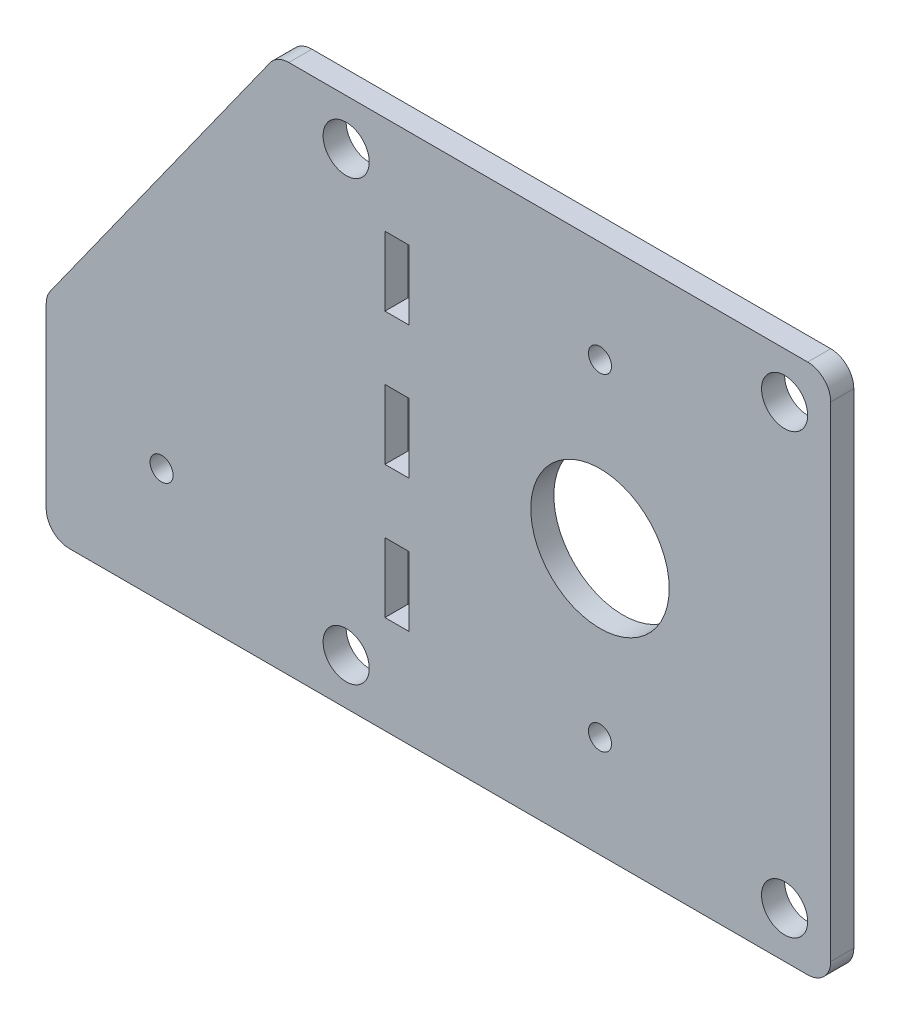
ISO-10303-21;
HEADER;
FILE_DESCRIPTION(('STEP AP214'),'2;1');
FILE_NAME('part.step','',(''),(''),'','','');
FILE_SCHEMA(('AUTOMOTIVE_DESIGN { 1 0 10303 214 1 1 1 1 }'));
ENDSEC;
DATA;
#1=APPLICATION_CONTEXT('core data for automotive mechanical design processes');
#2=APPLICATION_PROTOCOL_DEFINITION('international standard','automotive_design',2000,#1);
#3=PRODUCT_CONTEXT('',#1,'mechanical');
#4=PRODUCT('Part','Part','',(#3));
#5=PRODUCT_RELATED_PRODUCT_CATEGORY('part','',(#4));
#6=PRODUCT_DEFINITION_FORMATION('','',#4);
#7=PRODUCT_DEFINITION_CONTEXT('part definition',#1,'design');
#8=PRODUCT_DEFINITION('design','',#6,#7);
#9=PRODUCT_DEFINITION_SHAPE('','',#8);
#10=(LENGTH_UNIT() NAMED_UNIT(*) SI_UNIT(.MILLI.,.METRE.));
#11=(NAMED_UNIT(*) PLANE_ANGLE_UNIT() SI_UNIT($,.RADIAN.));
#12=(NAMED_UNIT(*) SI_UNIT($,.STERADIAN.) SOLID_ANGLE_UNIT());
#13=UNCERTAINTY_MEASURE_WITH_UNIT(LENGTH_MEASURE(1.E-05),#10,'distance_accuracy_value','');
#14=(GEOMETRIC_REPRESENTATION_CONTEXT(3) GLOBAL_UNCERTAINTY_ASSIGNED_CONTEXT((#13)) GLOBAL_UNIT_ASSIGNED_CONTEXT((#10,
#11,#12)) REPRESENTATION_CONTEXT('',''));
#15=CARTESIAN_POINT('',(0.,0.,0.));
#16=DIRECTION('',(0.,0.,1.));
#17=DIRECTION('',(1.,0.,0.));
#18=AXIS2_PLACEMENT_3D('',#15,#16,#17);
#19=CARTESIAN_POINT('',(0.,0.,3.175));
#20=DIRECTION('',(0.,0.,-1.));
#21=DIRECTION('',(-1.,0.,0.));
#22=AXIS2_PLACEMENT_3D('',#19,#20,#21);
#23=PLANE('',#22);
#24=CARTESIAN_POINT('',(-120.65,-41.275,3.175));
#25=DIRECTION('',(0.,0.,1.));
#26=DIRECTION('',(1.,0.,0.));
#27=AXIS2_PLACEMENT_3D('',#24,#25,#26);
#28=CIRCLE('',#27,3.175);
#29=CARTESIAN_POINT('',(-117.475,-41.275,3.175));
#30=VERTEX_POINT('',#29);
#31=EDGE_CURVE('E435',#30,#30,#28,.T.);
#32=ORIENTED_EDGE('',*,*,#31,.F.);
#33=EDGE_LOOP('',(#32));
#34=FACE_BOUND('',#33,.T.);
#35=DIRECTION('',(0.,1.,0.));
#36=VECTOR('',#35,1.);
#37=CARTESIAN_POINT('',(-52.578,-9.525,3.175));
#38=LINE('',#37,#36);
#39=CARTESIAN_POINT('',(-52.578,-9.525,3.175));
#40=VERTEX_POINT('',#39);
#41=CARTESIAN_POINT('',(-52.578,9.525,3.175));
#42=VERTEX_POINT('',#41);
#43=EDGE_CURVE('E228',#40,#42,#38,.T.);
#44=ORIENTED_EDGE('',*,*,#43,.F.);
#45=DIRECTION('',(1.,0.,0.));
#46=VECTOR('',#45,1.);
#47=CARTESIAN_POINT('',(-59.182,-9.525,3.175));
#48=LINE('',#47,#46);
#49=CARTESIAN_POINT('',(-59.182,-9.525,3.175));
#50=VERTEX_POINT('',#49);
#51=EDGE_CURVE('E236',#50,#40,#48,.T.);
#52=ORIENTED_EDGE('',*,*,#51,.F.);
#53=DIRECTION('',(0.,-1.,0.));
#54=VECTOR('',#53,1.);
#55=CARTESIAN_POINT('',(-59.182,-9.525,3.175));
#56=LINE('',#55,#54);
#57=CARTESIAN_POINT('',(-59.182,9.525,3.175));
#58=VERTEX_POINT('',#57);
#59=EDGE_CURVE('E233',#58,#50,#56,.T.);
#60=ORIENTED_EDGE('',*,*,#59,.F.);
#61=DIRECTION('',(-1.,0.,0.));
#62=VECTOR('',#61,1.);
#63=CARTESIAN_POINT('',(-59.182,9.525,3.175));
#64=LINE('',#63,#62);
#65=EDGE_CURVE('E230',#42,#58,#64,.T.);
#66=ORIENTED_EDGE('',*,*,#65,.F.);
#67=EDGE_LOOP('',(#44,#52,#60,#66));
#68=FACE_BOUND('',#67,.T.);
#69=CARTESIAN_POINT('',(-69.85,-60.325,3.175));
#70=DIRECTION('',(0.,0.,1.));
#71=DIRECTION('',(1.,0.,0.));
#72=AXIS2_PLACEMENT_3D('',#69,#70,#71);
#73=CIRCLE('',#72,6.35000000000001);
#74=CARTESIAN_POINT('',(-63.5,-60.325,3.175));
#75=VERTEX_POINT('',#74);
#76=EDGE_CURVE('E290',#75,#75,#73,.T.);
#77=ORIENTED_EDGE('',*,*,#76,.F.);
#78=EDGE_LOOP('',(#77));
#79=FACE_BOUND('',#78,.T.);
#80=CARTESIAN_POINT('',(-69.85,60.325,3.175));
#81=DIRECTION('',(0.,0.,1.));
#82=DIRECTION('',(1.,0.,0.));
#83=AXIS2_PLACEMENT_3D('',#80,#81,#82);
#84=CIRCLE('',#83,6.35000000000001);
#85=CARTESIAN_POINT('',(-63.5,60.325,3.175));
#86=VERTEX_POINT('',#85);
#87=EDGE_CURVE('E296',#86,#86,#84,.T.);
#88=ORIENTED_EDGE('',*,*,#87,.F.);
#89=EDGE_LOOP('',(#88));
#90=FACE_BOUND('',#89,.T.);
#91=CARTESIAN_POINT('',(0.,-45.,3.175));
#92=DIRECTION('',(0.,0.,1.));
#93=DIRECTION('',(1.,0.,0.));
#94=AXIS2_PLACEMENT_3D('',#91,#92,#93);
#95=CIRCLE('',#94,3.175);
#96=CARTESIAN_POINT('',(3.17500000000001,-45.,3.175));
#97=VERTEX_POINT('',#96);
#98=EDGE_CURVE('E302',#97,#97,#95,.T.);
#99=ORIENTED_EDGE('',*,*,#98,.F.);
#100=EDGE_LOOP('',(#99));
#101=FACE_BOUND('',#100,.T.);
#102=CARTESIAN_POINT('',(0.,0.,3.175));
#103=DIRECTION('',(0.,0.,1.));
#104=DIRECTION('',(1.,0.,0.));
#105=AXIS2_PLACEMENT_3D('',#102,#103,#104);
#106=CIRCLE('',#105,19.05);
#107=CARTESIAN_POINT('',(19.05,0.,3.175));
#108=VERTEX_POINT('',#107);
#109=EDGE_CURVE('E308',#108,#108,#106,.T.);
#110=ORIENTED_EDGE('',*,*,#109,.F.);
#111=EDGE_LOOP('',(#110));
#112=FACE_BOUND('',#111,.T.);
#113=CARTESIAN_POINT('',(0.,45.,3.175));
#114=DIRECTION('',(0.,0.,1.));
#115=DIRECTION('',(1.,0.,0.));
#116=AXIS2_PLACEMENT_3D('',#113,#114,#115);
#117=CIRCLE('',#116,3.175);
#118=CARTESIAN_POINT('',(3.17499999999999,45.,3.175));
#119=VERTEX_POINT('',#118);
#120=EDGE_CURVE('E314',#119,#119,#117,.T.);
#121=ORIENTED_EDGE('',*,*,#120,.F.);
#122=EDGE_LOOP('',(#121));
#123=FACE_BOUND('',#122,.T.);
#124=CARTESIAN_POINT('',(50.8,-60.325,3.175));
#125=DIRECTION('',(0.,0.,1.));
#126=DIRECTION('',(1.,0.,0.));
#127=AXIS2_PLACEMENT_3D('',#124,#125,#126);
#128=CIRCLE('',#127,6.35);
#129=CARTESIAN_POINT('',(57.15,-60.325,3.175));
#130=VERTEX_POINT('',#129);
#131=EDGE_CURVE('E320',#130,#130,#128,.T.);
#132=ORIENTED_EDGE('',*,*,#131,.F.);
#133=EDGE_LOOP('',(#132));
#134=FACE_BOUND('',#133,.T.);
#135=CARTESIAN_POINT('',(50.8,60.325,3.175));
#136=DIRECTION('',(0.,0.,1.));
#137=DIRECTION('',(1.,0.,0.));
#138=AXIS2_PLACEMENT_3D('',#135,#136,#137);
#139=CIRCLE('',#138,6.35);
#140=CARTESIAN_POINT('',(57.15,60.325,3.175));
#141=VERTEX_POINT('',#140);
#142=EDGE_CURVE('E326',#141,#141,#139,.T.);
#143=ORIENTED_EDGE('',*,*,#142,.F.);
#144=EDGE_LOOP('',(#143));
#145=FACE_BOUND('',#144,.T.);
#146=DIRECTION('',(0.,1.,0.));
#147=VECTOR('',#146,1.);
#148=CARTESIAN_POINT('',(63.5,73.025,3.175));
#149=LINE('',#148,#147);
#150=CARTESIAN_POINT('',(63.5,-66.675,3.175));
#151=VERTEX_POINT('',#150);
#152=CARTESIAN_POINT('',(63.5,66.675,3.175));
#153=VERTEX_POINT('',#152);
#154=EDGE_CURVE('E337',#151,#153,#149,.T.);
#155=ORIENTED_EDGE('',*,*,#154,.T.);
#156=CARTESIAN_POINT('',(57.15,66.675,3.175));
#157=DIRECTION('',(0.,0.,-1.));
#158=DIRECTION('',(-1.,0.,0.));
#159=AXIS2_PLACEMENT_3D('',#156,#157,#158);
#160=CIRCLE('',#159,6.35);
#161=CARTESIAN_POINT('',(57.15,73.025,3.175));
#162=VERTEX_POINT('',#161);
#163=EDGE_CURVE('E380',#153,#162,#160,.F.);
#164=ORIENTED_EDGE('',*,*,#163,.T.);
#165=DIRECTION('',(-1.,0.,0.));
#166=VECTOR('',#165,1.);
#167=CARTESIAN_POINT('',(63.5,73.025,3.175));
#168=LINE('',#167,#166);
#169=CARTESIAN_POINT('',(-85.6321763648971,73.025,3.175));
#170=VERTEX_POINT('',#169);
#171=EDGE_CURVE('E340',#162,#170,#168,.T.);
#172=ORIENTED_EDGE('',*,*,#171,.T.);
#173=CARTESIAN_POINT('',(-85.6321763648971,66.675,3.175));
#174=DIRECTION('',(0.,0.,-1.));
#175=DIRECTION('',(-1.,0.,0.));
#176=AXIS2_PLACEMENT_3D('',#173,#174,#175);
#177=CIRCLE('',#176,6.35);
#178=CARTESIAN_POINT('',(-90.7993839070598,70.3658625301163,3.175));
#179=VERTEX_POINT('',#178);
#180=EDGE_CURVE('E376',#170,#179,#177,.F.);
#181=ORIENTED_EDGE('',*,*,#180,.T.);
#182=DIRECTION('',(0.581238193719096,0.813733471206735,0.));
#183=VECTOR('',#182,1.);
#184=CARTESIAN_POINT('',(-88.9,73.025,3.175));
#185=LINE('',#184,#183);
#186=CARTESIAN_POINT('',(-151.217207542163,-14.2190905590279,3.175));
#187=VERTEX_POINT('',#186);
#188=EDGE_CURVE('E431',#187,#179,#185,.T.);
#189=ORIENTED_EDGE('',*,*,#188,.F.);
#190=CARTESIAN_POINT('',(-146.05,-17.9099530891441,3.175));
#191=DIRECTION('',(0.,0.,-1.));
#192=DIRECTION('',(-1.,0.,0.));
#193=AXIS2_PLACEMENT_3D('',#190,#191,#192);
#194=CIRCLE('',#193,6.35);
#195=CARTESIAN_POINT('',(-152.4,-17.9099530891441,3.175));
#196=VERTEX_POINT('',#195);
#197=EDGE_CURVE('E374',#187,#196,#194,.F.);
#198=ORIENTED_EDGE('',*,*,#197,.T.);
#199=DIRECTION('',(0.,-1.,0.));
#200=VECTOR('',#199,1.);
#201=CARTESIAN_POINT('',(-152.4,73.025,3.175));
#202=LINE('',#201,#200);
#203=CARTESIAN_POINT('',(-152.4,-66.675,3.175));
#204=VERTEX_POINT('',#203);
#205=EDGE_CURVE('E332',#196,#204,#202,.T.);
#206=ORIENTED_EDGE('',*,*,#205,.T.);
#207=CARTESIAN_POINT('',(-146.05,-66.675,3.175));
#208=DIRECTION('',(0.,0.,-1.));
#209=DIRECTION('',(-1.,0.,0.));
#210=AXIS2_PLACEMENT_3D('',#207,#208,#209);
#211=CIRCLE('',#210,6.35);
#212=CARTESIAN_POINT('',(-146.05,-73.025,3.175));
#213=VERTEX_POINT('',#212);
#214=EDGE_CURVE('E56',#204,#213,#211,.F.);
#215=ORIENTED_EDGE('',*,*,#214,.T.);
#216=DIRECTION('',(1.,0.,0.));
#217=VECTOR('',#216,1.);
#218=CARTESIAN_POINT('',(63.5,-73.025,3.175));
#219=LINE('',#218,#217);
#220=CARTESIAN_POINT('',(57.15,-73.025,3.175));
#221=VERTEX_POINT('',#220);
#222=EDGE_CURVE('E334',#213,#221,#219,.T.);
#223=ORIENTED_EDGE('',*,*,#222,.T.);
#224=CARTESIAN_POINT('',(57.15,-66.675,3.175));
#225=DIRECTION('',(0.,0.,-1.));
#226=DIRECTION('',(-1.,0.,0.));
#227=AXIS2_PLACEMENT_3D('',#224,#225,#226);
#228=CIRCLE('',#227,6.35);
#229=EDGE_CURVE('E378',#221,#151,#228,.F.);
#230=ORIENTED_EDGE('',*,*,#229,.T.);
#231=EDGE_LOOP('',(#155,#164,#172,#181,#189,#198,#206,#215,#223,#230));
#232=FACE_BOUND('',#231,.T.);
#233=DIRECTION('',(0.,1.,0.));
#234=VECTOR('',#233,1.);
#235=CARTESIAN_POINT('',(-52.578,46.0375,3.175));
#236=LINE('',#235,#234);
#237=CARTESIAN_POINT('',(-52.578,26.9875,3.175));
#238=VERTEX_POINT('',#237);
#239=CARTESIAN_POINT('',(-52.578,46.0375,3.175));
#240=VERTEX_POINT('',#239);
#241=EDGE_CURVE('E259',#238,#240,#236,.T.);
#242=ORIENTED_EDGE('',*,*,#241,.F.);
#243=DIRECTION('',(1.,0.,0.));
#244=VECTOR('',#243,1.);
#245=CARTESIAN_POINT('',(-59.182,26.9875,3.175));
#246=LINE('',#245,#244);
#247=CARTESIAN_POINT('',(-59.182,26.9875,3.175));
#248=VERTEX_POINT('',#247);
#249=EDGE_CURVE('E267',#248,#238,#246,.T.);
#250=ORIENTED_EDGE('',*,*,#249,.F.);
#251=DIRECTION('',(0.,-1.,0.));
#252=VECTOR('',#251,1.);
#253=CARTESIAN_POINT('',(-59.182,46.0375,3.175));
#254=LINE('',#253,#252);
#255=CARTESIAN_POINT('',(-59.182,46.0375,3.175));
#256=VERTEX_POINT('',#255);
#257=EDGE_CURVE('E264',#256,#248,#254,.T.);
#258=ORIENTED_EDGE('',*,*,#257,.F.);
#259=DIRECTION('',(-1.,0.,0.));
#260=VECTOR('',#259,1.);
#261=CARTESIAN_POINT('',(-59.182,46.0375,3.175));
#262=LINE('',#261,#260);
#263=EDGE_CURVE('E261',#240,#256,#262,.T.);
#264=ORIENTED_EDGE('',*,*,#263,.F.);
#265=EDGE_LOOP('',(#242,#250,#258,#264));
#266=FACE_BOUND('',#265,.T.);
#267=DIRECTION('',(0.,1.,0.));
#268=VECTOR('',#267,1.);
#269=CARTESIAN_POINT('',(-52.578,-26.9875,3.175));
#270=LINE('',#269,#268);
#271=CARTESIAN_POINT('',(-52.578,-46.0375,3.175));
#272=VERTEX_POINT('',#271);
#273=CARTESIAN_POINT('',(-52.578,-26.9875,3.175));
#274=VERTEX_POINT('',#273);
#275=EDGE_CURVE('E185',#272,#274,#270,.T.);
#276=ORIENTED_EDGE('',*,*,#275,.F.);
#277=DIRECTION('',(1.,0.,0.));
#278=VECTOR('',#277,1.);
#279=CARTESIAN_POINT('',(-59.182,-46.0375,3.175));
#280=LINE('',#279,#278);
#281=CARTESIAN_POINT('',(-59.182,-46.0375,3.175));
#282=VERTEX_POINT('',#281);
#283=EDGE_CURVE('E210',#282,#272,#280,.T.);
#284=ORIENTED_EDGE('',*,*,#283,.F.);
#285=DIRECTION('',(0.,-1.,0.));
#286=VECTOR('',#285,1.);
#287=CARTESIAN_POINT('',(-59.182,-26.9875,3.175));
#288=LINE('',#287,#286);
#289=CARTESIAN_POINT('',(-59.182,-26.9875,3.175));
#290=VERTEX_POINT('',#289);
#291=EDGE_CURVE('E208',#290,#282,#288,.T.);
#292=ORIENTED_EDGE('',*,*,#291,.F.);
#293=DIRECTION('',(-1.,0.,0.));
#294=VECTOR('',#293,1.);
#295=CARTESIAN_POINT('',(-59.182,-26.9875,3.175));
#296=LINE('',#295,#294);
#297=EDGE_CURVE('E195',#274,#290,#296,.T.);
#298=ORIENTED_EDGE('',*,*,#297,.F.);
#299=EDGE_LOOP('',(#276,#284,#292,#298));
#300=FACE_BOUND('',#299,.T.);
#301=ADVANCED_FACE('F34',(#34,#68,#79,#90,#101,#112,#123,#134,#145,#232,#266,#300),#23,.F.);
#302=CARTESIAN_POINT('',(0.,0.,-3.175));
#303=DIRECTION('',(0.,0.,-1.));
#304=DIRECTION('',(-1.,0.,0.));
#305=AXIS2_PLACEMENT_3D('',#302,#303,#304);
#306=PLANE('',#305);
#307=CARTESIAN_POINT('',(-120.65,-41.275,-3.175));
#308=DIRECTION('',(0.,0.,1.));
#309=DIRECTION('',(1.,0.,0.));
#310=AXIS2_PLACEMENT_3D('',#307,#308,#309);
#311=CIRCLE('',#310,3.175);
#312=CARTESIAN_POINT('',(-117.475,-41.275,-3.175));
#313=VERTEX_POINT('',#312);
#314=EDGE_CURVE('E217',#313,#313,#311,.T.);
#315=ORIENTED_EDGE('',*,*,#314,.T.);
#316=EDGE_LOOP('',(#315));
#317=FACE_BOUND('',#316,.T.);
#318=DIRECTION('',(-1.,0.,0.));
#319=VECTOR('',#318,1.);
#320=CARTESIAN_POINT('',(63.5,73.025,-3.175));
#321=LINE('',#320,#319);
#322=CARTESIAN_POINT('',(57.15,73.025,-3.175));
#323=VERTEX_POINT('',#322);
#324=CARTESIAN_POINT('',(-85.6321763648971,73.025,-3.175));
#325=VERTEX_POINT('',#324);
#326=EDGE_CURVE('E335',#323,#325,#321,.T.);
#327=ORIENTED_EDGE('',*,*,#326,.F.);
#328=CARTESIAN_POINT('',(57.15,66.675,-3.175));
#329=DIRECTION('',(0.,0.,-1.));
#330=DIRECTION('',(-1.,0.,0.));
#331=AXIS2_PLACEMENT_3D('',#328,#329,#330);
#332=CIRCLE('',#331,6.35);
#333=CARTESIAN_POINT('',(63.5,66.675,-3.175));
#334=VERTEX_POINT('',#333);
#335=EDGE_CURVE('E366',#323,#334,#332,.T.);
#336=ORIENTED_EDGE('',*,*,#335,.T.);
#337=DIRECTION('',(0.,1.,0.));
#338=VECTOR('',#337,1.);
#339=CARTESIAN_POINT('',(63.5,73.025,-3.175));
#340=LINE('',#339,#338);
#341=CARTESIAN_POINT('',(63.5,-66.675,-3.175));
#342=VERTEX_POINT('',#341);
#343=EDGE_CURVE('E348',#342,#334,#340,.T.);
#344=ORIENTED_EDGE('',*,*,#343,.F.);
#345=CARTESIAN_POINT('',(57.15,-66.675,-3.175));
#346=DIRECTION('',(0.,0.,-1.));
#347=DIRECTION('',(-1.,0.,0.));
#348=AXIS2_PLACEMENT_3D('',#345,#346,#347);
#349=CIRCLE('',#348,6.35);
#350=CARTESIAN_POINT('',(57.15,-73.025,-3.175));
#351=VERTEX_POINT('',#350);
#352=EDGE_CURVE('E364',#342,#351,#349,.T.);
#353=ORIENTED_EDGE('',*,*,#352,.T.);
#354=DIRECTION('',(1.,0.,0.));
#355=VECTOR('',#354,1.);
#356=CARTESIAN_POINT('',(63.5,-73.025,-3.175));
#357=LINE('',#356,#355);
#358=CARTESIAN_POINT('',(-146.05,-73.025,-3.175));
#359=VERTEX_POINT('',#358);
#360=EDGE_CURVE('E346',#359,#351,#357,.T.);
#361=ORIENTED_EDGE('',*,*,#360,.F.);
#362=CARTESIAN_POINT('',(-146.05,-66.675,-3.175));
#363=DIRECTION('',(0.,0.,-1.));
#364=DIRECTION('',(-1.,0.,0.));
#365=AXIS2_PLACEMENT_3D('',#362,#363,#364);
#366=CIRCLE('',#365,6.35);
#367=CARTESIAN_POINT('',(-152.4,-66.675,-3.175));
#368=VERTEX_POINT('',#367);
#369=EDGE_CURVE('E358',#359,#368,#366,.T.);
#370=ORIENTED_EDGE('',*,*,#369,.T.);
#371=DIRECTION('',(0.,-1.,0.));
#372=VECTOR('',#371,1.);
#373=CARTESIAN_POINT('',(-152.4,73.025,-3.175));
#374=LINE('',#373,#372);
#375=CARTESIAN_POINT('',(-152.4,-17.9099530891441,-3.175));
#376=VERTEX_POINT('',#375);
#377=EDGE_CURVE('E329',#376,#368,#374,.T.);
#378=ORIENTED_EDGE('',*,*,#377,.F.);
#379=CARTESIAN_POINT('',(-146.05,-17.9099530891441,-3.175));
#380=DIRECTION('',(0.,0.,-1.));
#381=DIRECTION('',(-1.,0.,0.));
#382=AXIS2_PLACEMENT_3D('',#379,#380,#381);
#383=CIRCLE('',#382,6.35);
#384=CARTESIAN_POINT('',(-151.217207542163,-14.2190905590279,-3.175));
#385=VERTEX_POINT('',#384);
#386=EDGE_CURVE('E360',#376,#385,#383,.T.);
#387=ORIENTED_EDGE('',*,*,#386,.T.);
#388=DIRECTION('',(0.581238193719096,0.813733471206735,0.));
#389=VECTOR('',#388,1.);
#390=CARTESIAN_POINT('',(-88.9,73.025,-3.175));
#391=LINE('',#390,#389);
#392=CARTESIAN_POINT('',(-90.7993839070598,70.3658625301163,-3.175));
#393=VERTEX_POINT('',#392);
#394=EDGE_CURVE('E426',#385,#393,#391,.T.);
#395=ORIENTED_EDGE('',*,*,#394,.T.);
#396=CARTESIAN_POINT('',(-85.6321763648971,66.675,-3.175));
#397=DIRECTION('',(0.,0.,-1.));
#398=DIRECTION('',(-1.,0.,0.));
#399=AXIS2_PLACEMENT_3D('',#396,#397,#398);
#400=CIRCLE('',#399,6.35);
#401=EDGE_CURVE('E362',#393,#325,#400,.T.);
#402=ORIENTED_EDGE('',*,*,#401,.T.);
#403=EDGE_LOOP('',(#327,#336,#344,#353,#361,#370,#378,#387,#395,#402));
#404=FACE_BOUND('',#403,.T.);
#405=CARTESIAN_POINT('',(-69.85,60.325,-3.175));
#406=DIRECTION('',(0.,0.,1.));
#407=DIRECTION('',(1.,0.,0.));
#408=AXIS2_PLACEMENT_3D('',#405,#406,#407);
#409=CIRCLE('',#408,6.35000000000001);
#410=CARTESIAN_POINT('',(-63.5,60.325,-3.175));
#411=VERTEX_POINT('',#410);
#412=EDGE_CURVE('E293',#411,#411,#409,.T.);
#413=ORIENTED_EDGE('',*,*,#412,.T.);
#414=EDGE_LOOP('',(#413));
#415=FACE_BOUND('',#414,.T.);
#416=CARTESIAN_POINT('',(0.,0.,-3.175));
#417=DIRECTION('',(0.,0.,1.));
#418=DIRECTION('',(1.,0.,0.));
#419=AXIS2_PLACEMENT_3D('',#416,#417,#418);
#420=CIRCLE('',#419,19.05);
#421=CARTESIAN_POINT('',(19.05,0.,-3.175));
#422=VERTEX_POINT('',#421);
#423=EDGE_CURVE('E305',#422,#422,#420,.T.);
#424=ORIENTED_EDGE('',*,*,#423,.T.);
#425=EDGE_LOOP('',(#424));
#426=FACE_BOUND('',#425,.T.);
#427=CARTESIAN_POINT('',(50.8,-60.325,-3.175));
#428=DIRECTION('',(0.,0.,1.));
#429=DIRECTION('',(1.,0.,0.));
#430=AXIS2_PLACEMENT_3D('',#427,#428,#429);
#431=CIRCLE('',#430,6.35);
#432=CARTESIAN_POINT('',(57.15,-60.325,-3.175));
#433=VERTEX_POINT('',#432);
#434=EDGE_CURVE('E317',#433,#433,#431,.T.);
#435=ORIENTED_EDGE('',*,*,#434,.T.);
#436=EDGE_LOOP('',(#435));
#437=FACE_BOUND('',#436,.T.);
#438=CARTESIAN_POINT('',(50.8,60.325,-3.175));
#439=DIRECTION('',(0.,0.,1.));
#440=DIRECTION('',(1.,0.,0.));
#441=AXIS2_PLACEMENT_3D('',#438,#439,#440);
#442=CIRCLE('',#441,6.35);
#443=CARTESIAN_POINT('',(57.15,60.325,-3.175));
#444=VERTEX_POINT('',#443);
#445=EDGE_CURVE('E323',#444,#444,#442,.T.);
#446=ORIENTED_EDGE('',*,*,#445,.T.);
#447=EDGE_LOOP('',(#446));
#448=FACE_BOUND('',#447,.T.);
#449=CARTESIAN_POINT('',(0.,45.,-3.175));
#450=DIRECTION('',(0.,0.,1.));
#451=DIRECTION('',(1.,0.,0.));
#452=AXIS2_PLACEMENT_3D('',#449,#450,#451);
#453=CIRCLE('',#452,3.175);
#454=CARTESIAN_POINT('',(3.17499999999999,45.,-3.175));
#455=VERTEX_POINT('',#454);
#456=EDGE_CURVE('E311',#455,#455,#453,.T.);
#457=ORIENTED_EDGE('',*,*,#456,.T.);
#458=EDGE_LOOP('',(#457));
#459=FACE_BOUND('',#458,.T.);
#460=CARTESIAN_POINT('',(0.,-45.,-3.175));
#461=DIRECTION('',(0.,0.,1.));
#462=DIRECTION('',(1.,0.,0.));
#463=AXIS2_PLACEMENT_3D('',#460,#461,#462);
#464=CIRCLE('',#463,3.175);
#465=CARTESIAN_POINT('',(3.17500000000001,-45.,-3.175));
#466=VERTEX_POINT('',#465);
#467=EDGE_CURVE('E299',#466,#466,#464,.T.);
#468=ORIENTED_EDGE('',*,*,#467,.T.);
#469=EDGE_LOOP('',(#468));
#470=FACE_BOUND('',#469,.T.);
#471=CARTESIAN_POINT('',(-69.85,-60.325,-3.175));
#472=DIRECTION('',(0.,0.,1.));
#473=DIRECTION('',(1.,0.,0.));
#474=AXIS2_PLACEMENT_3D('',#471,#472,#473);
#475=CIRCLE('',#474,6.35000000000001);
#476=CARTESIAN_POINT('',(-63.5,-60.325,-3.175));
#477=VERTEX_POINT('',#476);
#478=EDGE_CURVE('E289',#477,#477,#475,.T.);
#479=ORIENTED_EDGE('',*,*,#478,.T.);
#480=EDGE_LOOP('',(#479));
#481=FACE_BOUND('',#480,.T.);
#482=DIRECTION('',(1.,0.,0.));
#483=VECTOR('',#482,1.);
#484=CARTESIAN_POINT('',(-59.182,26.9875,-3.175));
#485=LINE('',#484,#483);
#486=CARTESIAN_POINT('',(-59.182,26.9875,-3.175));
#487=VERTEX_POINT('',#486);
#488=CARTESIAN_POINT('',(-52.578,26.9875,-3.175));
#489=VERTEX_POINT('',#488);
#490=EDGE_CURVE('E262',#487,#489,#485,.T.);
#491=ORIENTED_EDGE('',*,*,#490,.T.);
#492=DIRECTION('',(0.,1.,0.));
#493=VECTOR('',#492,1.);
#494=CARTESIAN_POINT('',(-52.578,46.0375,-3.175));
#495=LINE('',#494,#493);
#496=CARTESIAN_POINT('',(-52.578,46.0375,-3.175));
#497=VERTEX_POINT('',#496);
#498=EDGE_CURVE('E258',#489,#497,#495,.T.);
#499=ORIENTED_EDGE('',*,*,#498,.T.);
#500=DIRECTION('',(-1.,0.,0.));
#501=VECTOR('',#500,1.);
#502=CARTESIAN_POINT('',(-59.182,46.0375,-3.175));
#503=LINE('',#502,#501);
#504=CARTESIAN_POINT('',(-59.182,46.0375,-3.175));
#505=VERTEX_POINT('',#504);
#506=EDGE_CURVE('E272',#497,#505,#503,.T.);
#507=ORIENTED_EDGE('',*,*,#506,.T.);
#508=DIRECTION('',(0.,-1.,0.));
#509=VECTOR('',#508,1.);
#510=CARTESIAN_POINT('',(-59.182,46.0375,-3.175));
#511=LINE('',#510,#509);
#512=EDGE_CURVE('E275',#505,#487,#511,.T.);
#513=ORIENTED_EDGE('',*,*,#512,.T.);
#514=EDGE_LOOP('',(#491,#499,#507,#513));
#515=FACE_BOUND('',#514,.T.);
#516=DIRECTION('',(1.,0.,0.));
#517=VECTOR('',#516,1.);
#518=CARTESIAN_POINT('',(-59.182,-9.525,-3.175));
#519=LINE('',#518,#517);
#520=CARTESIAN_POINT('',(-59.182,-9.525,-3.175));
#521=VERTEX_POINT('',#520);
#522=CARTESIAN_POINT('',(-52.578,-9.525,-3.175));
#523=VERTEX_POINT('',#522);
#524=EDGE_CURVE('E231',#521,#523,#519,.T.);
#525=ORIENTED_EDGE('',*,*,#524,.T.);
#526=DIRECTION('',(0.,1.,0.));
#527=VECTOR('',#526,1.);
#528=CARTESIAN_POINT('',(-52.578,-9.525,-3.175));
#529=LINE('',#528,#527);
#530=CARTESIAN_POINT('',(-52.578,9.525,-3.175));
#531=VERTEX_POINT('',#530);
#532=EDGE_CURVE('E203',#523,#531,#529,.T.);
#533=ORIENTED_EDGE('',*,*,#532,.T.);
#534=DIRECTION('',(-1.,0.,0.));
#535=VECTOR('',#534,1.);
#536=CARTESIAN_POINT('',(-59.182,9.525,-3.175));
#537=LINE('',#536,#535);
#538=CARTESIAN_POINT('',(-59.182,9.525,-3.175));
#539=VERTEX_POINT('',#538);
#540=EDGE_CURVE('E241',#531,#539,#537,.T.);
#541=ORIENTED_EDGE('',*,*,#540,.T.);
#542=DIRECTION('',(0.,-1.,0.));
#543=VECTOR('',#542,1.);
#544=CARTESIAN_POINT('',(-59.182,-9.525,-3.175));
#545=LINE('',#544,#543);
#546=EDGE_CURVE('E244',#539,#521,#545,.T.);
#547=ORIENTED_EDGE('',*,*,#546,.T.);
#548=EDGE_LOOP('',(#525,#533,#541,#547));
#549=FACE_BOUND('',#548,.T.);
#550=DIRECTION('',(1.,0.,0.));
#551=VECTOR('',#550,1.);
#552=CARTESIAN_POINT('',(-59.182,-46.0375,-3.175));
#553=LINE('',#552,#551);
#554=CARTESIAN_POINT('',(-59.182,-46.0375,-3.175));
#555=VERTEX_POINT('',#554);
#556=CARTESIAN_POINT('',(-52.578,-46.0375,-3.175));
#557=VERTEX_POINT('',#556);
#558=EDGE_CURVE('E196',#555,#557,#553,.T.);
#559=ORIENTED_EDGE('',*,*,#558,.T.);
#560=DIRECTION('',(0.,1.,0.));
#561=VECTOR('',#560,1.);
#562=CARTESIAN_POINT('',(-52.578,-26.9875,-3.175));
#563=LINE('',#562,#561);
#564=CARTESIAN_POINT('',(-52.578,-26.9875,-3.175));
#565=VERTEX_POINT('',#564);
#566=EDGE_CURVE('E215',#557,#565,#563,.T.);
#567=ORIENTED_EDGE('',*,*,#566,.T.);
#568=DIRECTION('',(-1.,0.,0.));
#569=VECTOR('',#568,1.);
#570=CARTESIAN_POINT('',(-59.182,-26.9875,-3.175));
#571=LINE('',#570,#569);
#572=CARTESIAN_POINT('',(-59.182,-26.9875,-3.175));
#573=VERTEX_POINT('',#572);
#574=EDGE_CURVE('E202',#565,#573,#571,.T.);
#575=ORIENTED_EDGE('',*,*,#574,.T.);
#576=DIRECTION('',(0.,-1.,0.));
#577=VECTOR('',#576,1.);
#578=CARTESIAN_POINT('',(-59.182,-26.9875,-3.175));
#579=LINE('',#578,#577);
#580=EDGE_CURVE('E219',#573,#555,#579,.T.);
#581=ORIENTED_EDGE('',*,*,#580,.T.);
#582=EDGE_LOOP('',(#559,#567,#575,#581));
#583=FACE_BOUND('',#582,.T.);
#584=ADVANCED_FACE('F404',(#317,#404,#415,#426,#437,#448,#459,#470,#481,#515,#549,#583),#306,.T.);
#585=CARTESIAN_POINT('',(-152.4,73.025,3.175));
#586=DIRECTION('',(1.,0.,0.));
#587=DIRECTION('',(0.,0.,-1.));
#588=AXIS2_PLACEMENT_3D('',#585,#586,#587);
#589=PLANE('',#588);
#590=ORIENTED_EDGE('',*,*,#205,.F.);
#591=DIRECTION('',(0.,0.,1.));
#592=VECTOR('',#591,1.);
#593=CARTESIAN_POINT('',(-152.4,-17.9099530891441,3.175));
#594=LINE('',#593,#592);
#595=EDGE_CURVE('E11',#196,#376,#594,.F.);
#596=ORIENTED_EDGE('',*,*,#595,.T.);
#597=ORIENTED_EDGE('',*,*,#377,.T.);
#598=DIRECTION('',(0.,0.,-1.));
#599=VECTOR('',#598,1.);
#600=CARTESIAN_POINT('',(-152.4,-66.675,3.175));
#601=LINE('',#600,#599);
#602=EDGE_CURVE('E42',#368,#204,#601,.F.);
#603=ORIENTED_EDGE('',*,*,#602,.T.);
#604=EDGE_LOOP('',(#590,#596,#597,#603));
#605=FACE_BOUND('',#604,.T.);
#606=ADVANCED_FACE('F393',(#605),#589,.F.);
#607=CARTESIAN_POINT('',(63.5,-73.025,3.175));
#608=DIRECTION('',(0.,1.,0.));
#609=DIRECTION('',(-1.,0.,0.));
#610=AXIS2_PLACEMENT_3D('',#607,#608,#609);
#611=PLANE('',#610);
#612=ORIENTED_EDGE('',*,*,#360,.T.);
#613=DIRECTION('',(0.,0.,-1.));
#614=VECTOR('',#613,1.);
#615=CARTESIAN_POINT('',(57.15,-73.025,3.175));
#616=LINE('',#615,#614);
#617=EDGE_CURVE('E49',#351,#221,#616,.F.);
#618=ORIENTED_EDGE('',*,*,#617,.T.);
#619=ORIENTED_EDGE('',*,*,#222,.F.);
#620=DIRECTION('',(0.,0.,-1.));
#621=VECTOR('',#620,1.);
#622=CARTESIAN_POINT('',(-146.05,-73.025,3.175));
#623=LINE('',#622,#621);
#624=EDGE_CURVE('E382',#213,#359,#623,.T.);
#625=ORIENTED_EDGE('',*,*,#624,.T.);
#626=EDGE_LOOP('',(#612,#618,#619,#625));
#627=FACE_BOUND('',#626,.T.);
#628=ADVANCED_FACE('F401',(#627),#611,.F.);
#629=CARTESIAN_POINT('',(63.5,73.025,3.175));
#630=DIRECTION('',(-1.,0.,0.));
#631=DIRECTION('',(0.,-1.,0.));
#632=AXIS2_PLACEMENT_3D('',#629,#630,#631);
#633=PLANE('',#632);
#634=ORIENTED_EDGE('',*,*,#343,.T.);
#635=DIRECTION('',(0.,0.,-1.));
#636=VECTOR('',#635,1.);
#637=CARTESIAN_POINT('',(63.5,66.675,3.175));
#638=LINE('',#637,#636);
#639=EDGE_CURVE('E371',#334,#153,#638,.F.);
#640=ORIENTED_EDGE('',*,*,#639,.T.);
#641=ORIENTED_EDGE('',*,*,#154,.F.);
#642=DIRECTION('',(0.,0.,-1.));
#643=VECTOR('',#642,1.);
#644=CARTESIAN_POINT('',(63.5,-66.675,3.175));
#645=LINE('',#644,#643);
#646=EDGE_CURVE('E368',#151,#342,#645,.T.);
#647=ORIENTED_EDGE('',*,*,#646,.T.);
#648=EDGE_LOOP('',(#634,#640,#641,#647));
#649=FACE_BOUND('',#648,.T.);
#650=ADVANCED_FACE('F413',(#649),#633,.F.);
#651=CARTESIAN_POINT('',(63.5,73.025,3.175));
#652=DIRECTION('',(0.,-1.,0.));
#653=DIRECTION('',(1.,0.,0.));
#654=AXIS2_PLACEMENT_3D('',#651,#652,#653);
#655=PLANE('',#654);
#656=ORIENTED_EDGE('',*,*,#171,.F.);
#657=DIRECTION('',(0.,0.,-1.));
#658=VECTOR('',#657,1.);
#659=CARTESIAN_POINT('',(57.15,73.025,3.175));
#660=LINE('',#659,#658);
#661=EDGE_CURVE('E355',#162,#323,#660,.T.);
#662=ORIENTED_EDGE('',*,*,#661,.T.);
#663=ORIENTED_EDGE('',*,*,#326,.T.);
#664=DIRECTION('',(0.,0.,1.));
#665=VECTOR('',#664,1.);
#666=CARTESIAN_POINT('',(-85.6321763648971,73.025,3.175));
#667=LINE('',#666,#665);
#668=EDGE_CURVE('E343',#325,#170,#667,.T.);
#669=ORIENTED_EDGE('',*,*,#668,.T.);
#670=EDGE_LOOP('',(#656,#662,#663,#669));
#671=FACE_BOUND('',#670,.T.);
#672=ADVANCED_FACE('F421',(#671),#655,.F.);
#673=CARTESIAN_POINT('',(50.8,60.325,3.175));
#674=DIRECTION('',(0.,0.,-1.));
#675=DIRECTION('',(-1.,0.,0.));
#676=AXIS2_PLACEMENT_3D('',#673,#674,#675);
#677=CYLINDRICAL_SURFACE('',#676,6.35);
#678=ORIENTED_EDGE('',*,*,#142,.T.);
#679=EDGE_LOOP('',(#678));
#680=FACE_BOUND('',#679,.T.);
#681=ORIENTED_EDGE('',*,*,#445,.F.);
#682=EDGE_LOOP('',(#681));
#683=FACE_BOUND('',#682,.T.);
#684=ADVANCED_FACE('F471',(#680,#683),#677,.F.);
#685=CARTESIAN_POINT('',(50.8,-60.325,3.175));
#686=DIRECTION('',(0.,0.,-1.));
#687=DIRECTION('',(-1.,0.,0.));
#688=AXIS2_PLACEMENT_3D('',#685,#686,#687);
#689=CYLINDRICAL_SURFACE('',#688,6.35);
#690=ORIENTED_EDGE('',*,*,#131,.T.);
#691=EDGE_LOOP('',(#690));
#692=FACE_BOUND('',#691,.T.);
#693=ORIENTED_EDGE('',*,*,#434,.F.);
#694=EDGE_LOOP('',(#693));
#695=FACE_BOUND('',#694,.T.);
#696=ADVANCED_FACE('F474',(#692,#695),#689,.F.);
#697=CARTESIAN_POINT('',(0.,45.,3.175));
#698=DIRECTION('',(0.,0.,-1.));
#699=DIRECTION('',(-1.,0.,0.));
#700=AXIS2_PLACEMENT_3D('',#697,#698,#699);
#701=CYLINDRICAL_SURFACE('',#700,3.175);
#702=ORIENTED_EDGE('',*,*,#120,.T.);
#703=EDGE_LOOP('',(#702));
#704=FACE_BOUND('',#703,.T.);
#705=ORIENTED_EDGE('',*,*,#456,.F.);
#706=EDGE_LOOP('',(#705));
#707=FACE_BOUND('',#706,.T.);
#708=ADVANCED_FACE('F556',(#704,#707),#701,.F.);
#709=CARTESIAN_POINT('',(0.,0.,3.175));
#710=DIRECTION('',(0.,0.,-1.));
#711=DIRECTION('',(-1.,0.,0.));
#712=AXIS2_PLACEMENT_3D('',#709,#710,#711);
#713=CYLINDRICAL_SURFACE('',#712,19.05);
#714=ORIENTED_EDGE('',*,*,#109,.T.);
#715=EDGE_LOOP('',(#714));
#716=FACE_BOUND('',#715,.T.);
#717=ORIENTED_EDGE('',*,*,#423,.F.);
#718=EDGE_LOOP('',(#717));
#719=FACE_BOUND('',#718,.T.);
#720=ADVANCED_FACE('F552',(#716,#719),#713,.F.);
#721=CARTESIAN_POINT('',(0.,-45.,3.175));
#722=DIRECTION('',(0.,0.,-1.));
#723=DIRECTION('',(-1.,0.,0.));
#724=AXIS2_PLACEMENT_3D('',#721,#722,#723);
#725=CYLINDRICAL_SURFACE('',#724,3.175);
#726=ORIENTED_EDGE('',*,*,#98,.T.);
#727=EDGE_LOOP('',(#726));
#728=FACE_BOUND('',#727,.T.);
#729=ORIENTED_EDGE('',*,*,#467,.F.);
#730=EDGE_LOOP('',(#729));
#731=FACE_BOUND('',#730,.T.);
#732=ADVANCED_FACE('F548',(#728,#731),#725,.F.);
#733=CARTESIAN_POINT('',(-69.85,60.325,3.175));
#734=DIRECTION('',(0.,0.,-1.));
#735=DIRECTION('',(-1.,0.,0.));
#736=AXIS2_PLACEMENT_3D('',#733,#734,#735);
#737=CYLINDRICAL_SURFACE('',#736,6.35000000000001);
#738=ORIENTED_EDGE('',*,*,#87,.T.);
#739=EDGE_LOOP('',(#738));
#740=FACE_BOUND('',#739,.T.);
#741=ORIENTED_EDGE('',*,*,#412,.F.);
#742=EDGE_LOOP('',(#741));
#743=FACE_BOUND('',#742,.T.);
#744=ADVANCED_FACE('F544',(#740,#743),#737,.F.);
#745=CARTESIAN_POINT('',(-69.85,-60.325,3.175));
#746=DIRECTION('',(0.,0.,-1.));
#747=DIRECTION('',(-1.,0.,0.));
#748=AXIS2_PLACEMENT_3D('',#745,#746,#747);
#749=CYLINDRICAL_SURFACE('',#748,6.35000000000001);
#750=ORIENTED_EDGE('',*,*,#76,.T.);
#751=EDGE_LOOP('',(#750));
#752=FACE_BOUND('',#751,.T.);
#753=ORIENTED_EDGE('',*,*,#478,.F.);
#754=EDGE_LOOP('',(#753));
#755=FACE_BOUND('',#754,.T.);
#756=ADVANCED_FACE('F540',(#752,#755),#749,.F.);
#757=CARTESIAN_POINT('',(-52.578,46.0375,3.175));
#758=DIRECTION('',(-1.,0.,0.));
#759=DIRECTION('',(0.,-1.,0.));
#760=AXIS2_PLACEMENT_3D('',#757,#758,#759);
#761=PLANE('',#760);
#762=ORIENTED_EDGE('',*,*,#498,.F.);
#763=DIRECTION('',(0.,0.,-1.));
#764=VECTOR('',#763,1.);
#765=CARTESIAN_POINT('',(-52.578,26.9875,3.175));
#766=LINE('',#765,#764);
#767=EDGE_CURVE('E269',#238,#489,#766,.T.);
#768=ORIENTED_EDGE('',*,*,#767,.F.);
#769=ORIENTED_EDGE('',*,*,#241,.T.);
#770=DIRECTION('',(0.,0.,-1.));
#771=VECTOR('',#770,1.);
#772=CARTESIAN_POINT('',(-52.578,46.0375,3.175));
#773=LINE('',#772,#771);
#774=EDGE_CURVE('E286',#240,#497,#773,.T.);
#775=ORIENTED_EDGE('',*,*,#774,.T.);
#776=EDGE_LOOP('',(#762,#768,#769,#775));
#777=FACE_BOUND('',#776,.T.);
#778=ADVANCED_FACE('F536',(#777),#761,.T.);
#779=CARTESIAN_POINT('',(-59.182,46.0375,3.175));
#780=DIRECTION('',(0.,-1.,0.));
#781=DIRECTION('',(0.,0.,-1.));
#782=AXIS2_PLACEMENT_3D('',#779,#780,#781);
#783=PLANE('',#782);
#784=ORIENTED_EDGE('',*,*,#506,.F.);
#785=ORIENTED_EDGE('',*,*,#774,.F.);
#786=ORIENTED_EDGE('',*,*,#263,.T.);
#787=DIRECTION('',(0.,0.,-1.));
#788=VECTOR('',#787,1.);
#789=CARTESIAN_POINT('',(-59.182,46.0375,3.175));
#790=LINE('',#789,#788);
#791=EDGE_CURVE('E284',#256,#505,#790,.T.);
#792=ORIENTED_EDGE('',*,*,#791,.T.);
#793=EDGE_LOOP('',(#784,#785,#786,#792));
#794=FACE_BOUND('',#793,.T.);
#795=ADVANCED_FACE('F532',(#794),#783,.T.);
#796=CARTESIAN_POINT('',(-59.182,46.0375,3.175));
#797=DIRECTION('',(1.,0.,0.));
#798=DIRECTION('',(0.,1.,0.));
#799=AXIS2_PLACEMENT_3D('',#796,#797,#798);
#800=PLANE('',#799);
#801=ORIENTED_EDGE('',*,*,#512,.F.);
#802=ORIENTED_EDGE('',*,*,#791,.F.);
#803=ORIENTED_EDGE('',*,*,#257,.T.);
#804=DIRECTION('',(0.,0.,-1.));
#805=VECTOR('',#804,1.);
#806=CARTESIAN_POINT('',(-59.182,26.9875,3.175));
#807=LINE('',#806,#805);
#808=EDGE_CURVE('E282',#248,#487,#807,.T.);
#809=ORIENTED_EDGE('',*,*,#808,.T.);
#810=EDGE_LOOP('',(#801,#802,#803,#809));
#811=FACE_BOUND('',#810,.T.);
#812=ADVANCED_FACE('F528',(#811),#800,.T.);
#813=CARTESIAN_POINT('',(-59.182,26.9875,3.175));
#814=DIRECTION('',(0.,1.,0.));
#815=DIRECTION('',(-1.,0.,0.));
#816=AXIS2_PLACEMENT_3D('',#813,#814,#815);
#817=PLANE('',#816);
#818=ORIENTED_EDGE('',*,*,#490,.F.);
#819=ORIENTED_EDGE('',*,*,#808,.F.);
#820=ORIENTED_EDGE('',*,*,#249,.T.);
#821=ORIENTED_EDGE('',*,*,#767,.T.);
#822=EDGE_LOOP('',(#818,#819,#820,#821));
#823=FACE_BOUND('',#822,.T.);
#824=ADVANCED_FACE('F524',(#823),#817,.T.);
#825=CARTESIAN_POINT('',(-52.578,-9.525,3.175));
#826=DIRECTION('',(-1.,0.,0.));
#827=DIRECTION('',(0.,0.,1.));
#828=AXIS2_PLACEMENT_3D('',#825,#826,#827);
#829=PLANE('',#828);
#830=ORIENTED_EDGE('',*,*,#532,.F.);
#831=DIRECTION('',(0.,0.,-1.));
#832=VECTOR('',#831,1.);
#833=CARTESIAN_POINT('',(-52.578,-9.525,3.175));
#834=LINE('',#833,#832);
#835=EDGE_CURVE('E238',#40,#523,#834,.T.);
#836=ORIENTED_EDGE('',*,*,#835,.F.);
#837=ORIENTED_EDGE('',*,*,#43,.T.);
#838=DIRECTION('',(0.,0.,-1.));
#839=VECTOR('',#838,1.);
#840=CARTESIAN_POINT('',(-52.578,9.525,3.175));
#841=LINE('',#840,#839);
#842=EDGE_CURVE('E255',#42,#531,#841,.T.);
#843=ORIENTED_EDGE('',*,*,#842,.T.);
#844=EDGE_LOOP('',(#830,#836,#837,#843));
#845=FACE_BOUND('',#844,.T.);
#846=ADVANCED_FACE('F520',(#845),#829,.T.);
#847=CARTESIAN_POINT('',(-59.182,9.525,3.175));
#848=DIRECTION('',(0.,-1.,0.));
#849=DIRECTION('',(0.,0.,-1.));
#850=AXIS2_PLACEMENT_3D('',#847,#848,#849);
#851=PLANE('',#850);
#852=ORIENTED_EDGE('',*,*,#540,.F.);
#853=ORIENTED_EDGE('',*,*,#842,.F.);
#854=ORIENTED_EDGE('',*,*,#65,.T.);
#855=DIRECTION('',(0.,0.,-1.));
#856=VECTOR('',#855,1.);
#857=CARTESIAN_POINT('',(-59.182,9.525,3.175));
#858=LINE('',#857,#856);
#859=EDGE_CURVE('E253',#58,#539,#858,.T.);
#860=ORIENTED_EDGE('',*,*,#859,.T.);
#861=EDGE_LOOP('',(#852,#853,#854,#860));
#862=FACE_BOUND('',#861,.T.);
#863=ADVANCED_FACE('F516',(#862),#851,.T.);
#864=CARTESIAN_POINT('',(-59.182,-9.525,3.175));
#865=DIRECTION('',(1.,0.,0.));
#866=DIRECTION('',(0.,0.,-1.));
#867=AXIS2_PLACEMENT_3D('',#864,#865,#866);
#868=PLANE('',#867);
#869=ORIENTED_EDGE('',*,*,#546,.F.);
#870=ORIENTED_EDGE('',*,*,#859,.F.);
#871=ORIENTED_EDGE('',*,*,#59,.T.);
#872=DIRECTION('',(0.,0.,-1.));
#873=VECTOR('',#872,1.);
#874=CARTESIAN_POINT('',(-59.182,-9.525,3.175));
#875=LINE('',#874,#873);
#876=EDGE_CURVE('E251',#50,#521,#875,.T.);
#877=ORIENTED_EDGE('',*,*,#876,.T.);
#878=EDGE_LOOP('',(#869,#870,#871,#877));
#879=FACE_BOUND('',#878,.T.);
#880=ADVANCED_FACE('F512',(#879),#868,.T.);
#881=CARTESIAN_POINT('',(-59.182,-9.525,3.175));
#882=DIRECTION('',(0.,1.,0.));
#883=DIRECTION('',(0.,0.,1.));
#884=AXIS2_PLACEMENT_3D('',#881,#882,#883);
#885=PLANE('',#884);
#886=ORIENTED_EDGE('',*,*,#524,.F.);
#887=ORIENTED_EDGE('',*,*,#876,.F.);
#888=ORIENTED_EDGE('',*,*,#51,.T.);
#889=ORIENTED_EDGE('',*,*,#835,.T.);
#890=EDGE_LOOP('',(#886,#887,#888,#889));
#891=FACE_BOUND('',#890,.T.);
#892=ADVANCED_FACE('F509',(#891),#885,.T.);
#893=CARTESIAN_POINT('',(-52.578,-26.9875,3.175));
#894=DIRECTION('',(-1.,0.,0.));
#895=DIRECTION('',(0.,0.,1.));
#896=AXIS2_PLACEMENT_3D('',#893,#894,#895);
#897=PLANE('',#896);
#898=ORIENTED_EDGE('',*,*,#566,.F.);
#899=DIRECTION('',(0.,0.,-1.));
#900=VECTOR('',#899,1.);
#901=CARTESIAN_POINT('',(-52.578,-46.0375,3.175));
#902=LINE('',#901,#900);
#903=EDGE_CURVE('E191',#272,#557,#902,.T.);
#904=ORIENTED_EDGE('',*,*,#903,.F.);
#905=ORIENTED_EDGE('',*,*,#275,.T.);
#906=DIRECTION('',(0.,0.,-1.));
#907=VECTOR('',#906,1.);
#908=CARTESIAN_POINT('',(-52.578,-26.9875,3.175));
#909=LINE('',#908,#907);
#910=EDGE_CURVE('E188',#274,#565,#909,.T.);
#911=ORIENTED_EDGE('',*,*,#910,.T.);
#912=EDGE_LOOP('',(#898,#904,#905,#911));
#913=FACE_BOUND('',#912,.T.);
#914=ADVANCED_FACE('F187',(#913),#897,.T.);
#915=CARTESIAN_POINT('',(-59.182,-26.9875,3.175));
#916=DIRECTION('',(0.,-1.,0.));
#917=DIRECTION('',(0.,0.,-1.));
#918=AXIS2_PLACEMENT_3D('',#915,#916,#917);
#919=PLANE('',#918);
#920=ORIENTED_EDGE('',*,*,#574,.F.);
#921=ORIENTED_EDGE('',*,*,#910,.F.);
#922=ORIENTED_EDGE('',*,*,#297,.T.);
#923=DIRECTION('',(0.,0.,-1.));
#924=VECTOR('',#923,1.);
#925=CARTESIAN_POINT('',(-59.182,-26.9875,3.175));
#926=LINE('',#925,#924);
#927=EDGE_CURVE('E204',#290,#573,#926,.T.);
#928=ORIENTED_EDGE('',*,*,#927,.T.);
#929=EDGE_LOOP('',(#920,#921,#922,#928));
#930=FACE_BOUND('',#929,.T.);
#931=ADVANCED_FACE('F199',(#930),#919,.T.);
#932=CARTESIAN_POINT('',(-59.182,-26.9875,3.175));
#933=DIRECTION('',(1.,0.,0.));
#934=DIRECTION('',(0.,0.,-1.));
#935=AXIS2_PLACEMENT_3D('',#932,#933,#934);
#936=PLANE('',#935);
#937=ORIENTED_EDGE('',*,*,#580,.F.);
#938=ORIENTED_EDGE('',*,*,#927,.F.);
#939=ORIENTED_EDGE('',*,*,#291,.T.);
#940=DIRECTION('',(0.,0.,-1.));
#941=VECTOR('',#940,1.);
#942=CARTESIAN_POINT('',(-59.182,-46.0375,3.175));
#943=LINE('',#942,#941);
#944=EDGE_CURVE('E225',#282,#555,#943,.T.);
#945=ORIENTED_EDGE('',*,*,#944,.T.);
#946=EDGE_LOOP('',(#937,#938,#939,#945));
#947=FACE_BOUND('',#946,.T.);
#948=ADVANCED_FACE('F496',(#947),#936,.T.);
#949=CARTESIAN_POINT('',(-59.182,-46.0375,3.175));
#950=DIRECTION('',(0.,1.,0.));
#951=DIRECTION('',(0.,0.,1.));
#952=AXIS2_PLACEMENT_3D('',#949,#950,#951);
#953=PLANE('',#952);
#954=ORIENTED_EDGE('',*,*,#558,.F.);
#955=ORIENTED_EDGE('',*,*,#944,.F.);
#956=ORIENTED_EDGE('',*,*,#283,.T.);
#957=ORIENTED_EDGE('',*,*,#903,.T.);
#958=EDGE_LOOP('',(#954,#955,#956,#957));
#959=FACE_BOUND('',#958,.T.);
#960=ADVANCED_FACE('F494',(#959),#953,.T.);
#961=CARTESIAN_POINT('',(-88.9,73.025,-3.175));
#962=DIRECTION('',(0.813733471206735,-0.581238193719096,0.));
#963=DIRECTION('',(0.581238193719096,0.813733471206735,0.));
#964=AXIS2_PLACEMENT_3D('',#961,#962,#963);
#965=PLANE('',#964);
#966=ORIENTED_EDGE('',*,*,#188,.T.);
#967=DIRECTION('',(0.,0.,1.));
#968=VECTOR('',#967,1.);
#969=CARTESIAN_POINT('',(-90.7993839070598,70.3658625301163,-3.175));
#970=LINE('',#969,#968);
#971=EDGE_CURVE('E389',#179,#393,#970,.F.);
#972=ORIENTED_EDGE('',*,*,#971,.T.);
#973=ORIENTED_EDGE('',*,*,#394,.F.);
#974=DIRECTION('',(0.,0.,1.));
#975=VECTOR('',#974,1.);
#976=CARTESIAN_POINT('',(-151.217207542163,-14.2190905590279,-3.175));
#977=LINE('',#976,#975);
#978=EDGE_CURVE('E386',#385,#187,#977,.T.);
#979=ORIENTED_EDGE('',*,*,#978,.T.);
#980=EDGE_LOOP('',(#966,#972,#973,#979));
#981=FACE_BOUND('',#980,.T.);
#982=ADVANCED_FACE('F433',(#981),#965,.F.);
#983=CARTESIAN_POINT('',(-120.65,-41.275,-3.175));
#984=DIRECTION('',(0.,0.,1.));
#985=DIRECTION('',(1.,0.,0.));
#986=AXIS2_PLACEMENT_3D('',#983,#984,#985);
#987=CYLINDRICAL_SURFACE('',#986,3.175);
#988=ORIENTED_EDGE('',*,*,#314,.F.);
#989=EDGE_LOOP('',(#988));
#990=FACE_BOUND('',#989,.T.);
#991=ORIENTED_EDGE('',*,*,#31,.T.);
#992=EDGE_LOOP('',(#991));
#993=FACE_BOUND('',#992,.T.);
#994=ADVANCED_FACE('F444',(#990,#993),#987,.F.);
#995=CARTESIAN_POINT('',(57.15,66.675,3.175));
#996=DIRECTION('',(0.,0.,-1.));
#997=DIRECTION('',(-1.,0.,0.));
#998=AXIS2_PLACEMENT_3D('',#995,#996,#997);
#999=CYLINDRICAL_SURFACE('',#998,6.35);
#1000=ORIENTED_EDGE('',*,*,#163,.F.);
#1001=ORIENTED_EDGE('',*,*,#639,.F.);
#1002=ORIENTED_EDGE('',*,*,#335,.F.);
#1003=ORIENTED_EDGE('',*,*,#661,.F.);
#1004=EDGE_LOOP('',(#1000,#1001,#1002,#1003));
#1005=FACE_BOUND('',#1004,.T.);
#1006=ADVANCED_FACE('F419',(#1005),#999,.T.);
#1007=CARTESIAN_POINT('',(57.15,-66.675,3.175));
#1008=DIRECTION('',(0.,0.,-1.));
#1009=DIRECTION('',(-1.,0.,0.));
#1010=AXIS2_PLACEMENT_3D('',#1007,#1008,#1009);
#1011=CYLINDRICAL_SURFACE('',#1010,6.35);
#1012=ORIENTED_EDGE('',*,*,#229,.F.);
#1013=ORIENTED_EDGE('',*,*,#617,.F.);
#1014=ORIENTED_EDGE('',*,*,#352,.F.);
#1015=ORIENTED_EDGE('',*,*,#646,.F.);
#1016=EDGE_LOOP('',(#1012,#1013,#1014,#1015));
#1017=FACE_BOUND('',#1016,.T.);
#1018=ADVANCED_FACE('F410',(#1017),#1011,.T.);
#1019=CARTESIAN_POINT('',(-85.6321763648971,66.675,3.175));
#1020=DIRECTION('',(0.,0.,1.));
#1021=DIRECTION('',(1.,0.,0.));
#1022=AXIS2_PLACEMENT_3D('',#1019,#1020,#1021);
#1023=CYLINDRICAL_SURFACE('',#1022,6.35);
#1024=ORIENTED_EDGE('',*,*,#401,.F.);
#1025=ORIENTED_EDGE('',*,*,#971,.F.);
#1026=ORIENTED_EDGE('',*,*,#180,.F.);
#1027=ORIENTED_EDGE('',*,*,#668,.F.);
#1028=EDGE_LOOP('',(#1024,#1025,#1026,#1027));
#1029=FACE_BOUND('',#1028,.T.);
#1030=ADVANCED_FACE('F429',(#1029),#1023,.T.);
#1031=CARTESIAN_POINT('',(-146.05,-17.9099530891441,-3.175));
#1032=DIRECTION('',(0.,0.,1.));
#1033=DIRECTION('',(1.,0.,0.));
#1034=AXIS2_PLACEMENT_3D('',#1031,#1032,#1033);
#1035=CYLINDRICAL_SURFACE('',#1034,6.35);
#1036=ORIENTED_EDGE('',*,*,#386,.F.);
#1037=ORIENTED_EDGE('',*,*,#595,.F.);
#1038=ORIENTED_EDGE('',*,*,#197,.F.);
#1039=ORIENTED_EDGE('',*,*,#978,.F.);
#1040=EDGE_LOOP('',(#1036,#1037,#1038,#1039));
#1041=FACE_BOUND('',#1040,.T.);
#1042=ADVANCED_FACE('F577',(#1041),#1035,.T.);
#1043=CARTESIAN_POINT('',(-146.05,-66.675,3.175));
#1044=DIRECTION('',(0.,0.,-1.));
#1045=DIRECTION('',(-1.,0.,0.));
#1046=AXIS2_PLACEMENT_3D('',#1043,#1044,#1045);
#1047=CYLINDRICAL_SURFACE('',#1046,6.35);
#1048=ORIENTED_EDGE('',*,*,#214,.F.);
#1049=ORIENTED_EDGE('',*,*,#602,.F.);
#1050=ORIENTED_EDGE('',*,*,#369,.F.);
#1051=ORIENTED_EDGE('',*,*,#624,.F.);
#1052=EDGE_LOOP('',(#1048,#1049,#1050,#1051));
#1053=FACE_BOUND('',#1052,.T.);
#1054=ADVANCED_FACE('F36',(#1053),#1047,.T.);
#1055=CLOSED_SHELL('',(#301,#584,#606,#628,#650,#672,#684,#696,#708,#720,#732,#744,#756,#778,
#795,#812,#824,#846,#863,#880,#892,#914,#931,#948,#960,#982,#994,#1006,#1018,#1030,#1042,#1054));
#1056=MANIFOLD_SOLID_BREP('B2',#1055);
#1057=ADVANCED_BREP_SHAPE_REPRESENTATION('',(#18,#1056),#14);
#1058=SHAPE_DEFINITION_REPRESENTATION(#9,#1057);
ENDSEC;
END-ISO-10303-21;
